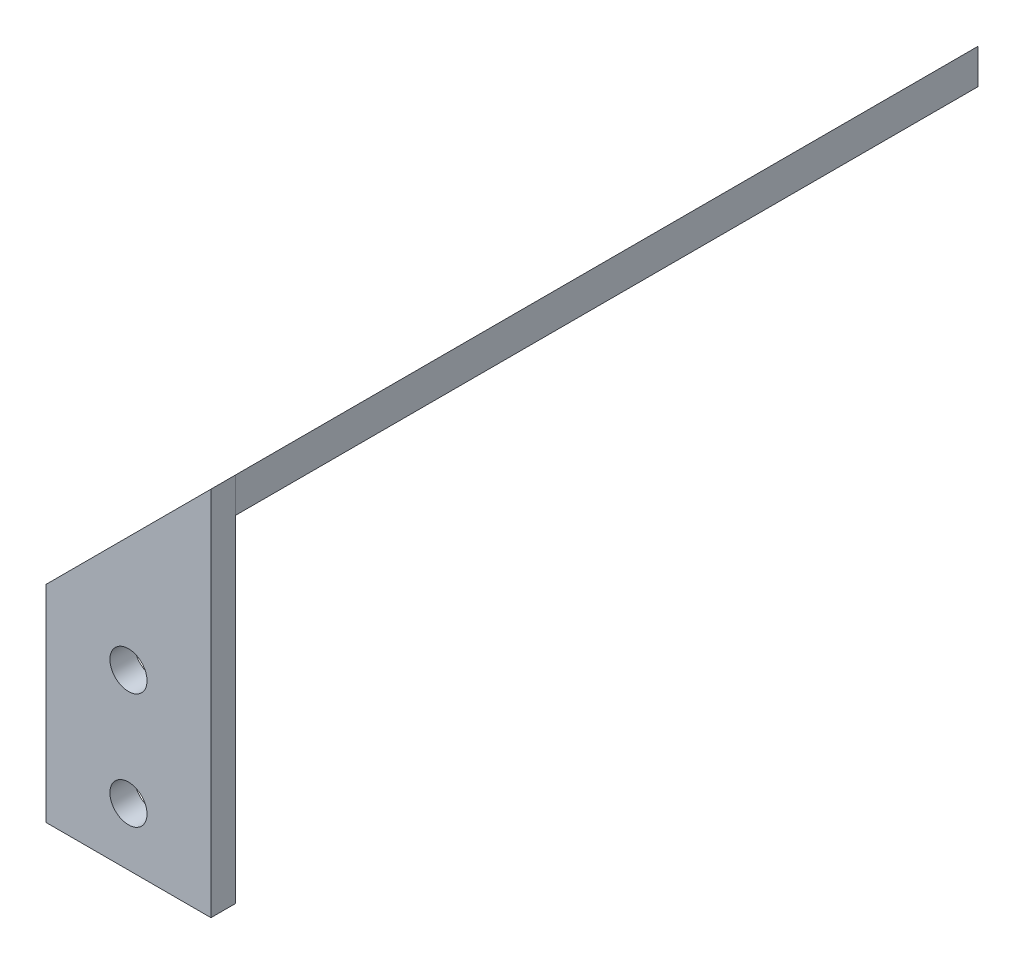
ISO-10303-21;
HEADER;
FILE_DESCRIPTION(('STEP AP214'),'2;1');
FILE_NAME('part.step','',(''),(''),'','','');
FILE_SCHEMA(('AUTOMOTIVE_DESIGN { 1 0 10303 214 1 1 1 1 }'));
ENDSEC;
DATA;
#1=APPLICATION_CONTEXT('core data for automotive mechanical design processes');
#2=APPLICATION_PROTOCOL_DEFINITION('international standard','automotive_design',2000,#1);
#3=PRODUCT_CONTEXT('',#1,'mechanical');
#4=PRODUCT('Part','Part','',(#3));
#5=PRODUCT_RELATED_PRODUCT_CATEGORY('part','',(#4));
#6=PRODUCT_DEFINITION_FORMATION('','',#4);
#7=PRODUCT_DEFINITION_CONTEXT('part definition',#1,'design');
#8=PRODUCT_DEFINITION('design','',#6,#7);
#9=PRODUCT_DEFINITION_SHAPE('','',#8);
#10=(LENGTH_UNIT() NAMED_UNIT(*) SI_UNIT(.MILLI.,.METRE.));
#11=(NAMED_UNIT(*) PLANE_ANGLE_UNIT() SI_UNIT($,.RADIAN.));
#12=(NAMED_UNIT(*) SI_UNIT($,.STERADIAN.) SOLID_ANGLE_UNIT());
#13=UNCERTAINTY_MEASURE_WITH_UNIT(LENGTH_MEASURE(1.E-05),#10,'distance_accuracy_value','');
#14=(GEOMETRIC_REPRESENTATION_CONTEXT(3) GLOBAL_UNCERTAINTY_ASSIGNED_CONTEXT((#13)) GLOBAL_UNIT_ASSIGNED_CONTEXT((#10,
#11,#12)) REPRESENTATION_CONTEXT('',''));
#15=CARTESIAN_POINT('',(0.,0.,0.));
#16=DIRECTION('',(0.,0.,1.));
#17=DIRECTION('',(1.,0.,0.));
#18=AXIS2_PLACEMENT_3D('',#15,#16,#17);
#19=CARTESIAN_POINT('',(22.1213203435596,42.8786796564403,0.));
#20=DIRECTION('',(0.,0.,1.));
#21=DIRECTION('',(1.,0.,0.));
#22=AXIS2_PLACEMENT_3D('',#19,#20,#21);
#23=PLANE('',#22);
#24=DIRECTION('',(0.,-1.,0.));
#25=VECTOR('',#24,1.);
#26=CARTESIAN_POINT('',(20.,44.9999999999999,0.));
#27=LINE('',#26,#25);
#28=CARTESIAN_POINT('',(20.,44.9999999999999,0.));
#29=VERTEX_POINT('',#28);
#30=CARTESIAN_POINT('',(20.,40.7573593128808,0.));
#31=VERTEX_POINT('',#30);
#32=EDGE_CURVE('E85',#29,#31,#27,.T.);
#33=ORIENTED_EDGE('',*,*,#32,.F.);
#34=DIRECTION('',(0.707106781186549,0.707106781186546,0.));
#35=VECTOR('',#34,1.);
#36=CARTESIAN_POINT('',(20.,44.9999999999999,0.));
#37=LINE('',#36,#35);
#38=CARTESIAN_POINT('',(0.,25.,0.));
#39=VERTEX_POINT('',#38);
#40=EDGE_CURVE('E82',#39,#29,#37,.T.);
#41=ORIENTED_EDGE('',*,*,#40,.F.);
#42=DIRECTION('',(-0.707106781186546,0.707106781186549,0.));
#43=VECTOR('',#42,1.);
#44=CARTESIAN_POINT('',(2.12132034355964,22.8786796564404,0.));
#45=LINE('',#44,#43);
#46=CARTESIAN_POINT('',(2.12132034355964,22.8786796564404,0.));
#47=VERTEX_POINT('',#46);
#48=EDGE_CURVE('E12',#47,#39,#45,.T.);
#49=ORIENTED_EDGE('',*,*,#48,.F.);
#50=DIRECTION('',(0.707106781186549,0.707106781186546,0.));
#51=VECTOR('',#50,1.);
#52=CARTESIAN_POINT('',(22.1213203435596,42.8786796564403,0.));
#53=LINE('',#52,#51);
#54=EDGE_CURVE('E93',#47,#31,#53,.T.);
#55=ORIENTED_EDGE('',*,*,#54,.T.);
#56=EDGE_LOOP('',(#33,#41,#49,#55));
#57=FACE_BOUND('',#56,.T.);
#58=ADVANCED_FACE('F43',(#57),#23,.T.);
#59=CARTESIAN_POINT('',(2.12132034355964,22.8786796564404,0.));
#60=DIRECTION('',(-0.707106781186549,-0.707106781186546,0.));
#61=DIRECTION('',(0.707106781186546,-0.707106781186549,0.));
#62=AXIS2_PLACEMENT_3D('',#59,#60,#61);
#63=PLANE('',#62);
#64=DIRECTION('',(0.,0.,1.));
#65=VECTOR('',#64,1.);
#66=CARTESIAN_POINT('',(0.,25.,0.));
#67=LINE('',#66,#65);
#68=CARTESIAN_POINT('',(0.,25.,-90.));
#69=VERTEX_POINT('',#68);
#70=EDGE_CURVE('E77',#69,#39,#67,.T.);
#71=ORIENTED_EDGE('',*,*,#70,.F.);
#72=DIRECTION('',(-0.707106781186546,0.707106781186549,0.));
#73=VECTOR('',#72,1.);
#74=CARTESIAN_POINT('',(2.12132034355963,22.8786796564403,-90.));
#75=LINE('',#74,#73);
#76=CARTESIAN_POINT('',(2.12132034355963,22.8786796564403,-90.));
#77=VERTEX_POINT('',#76);
#78=EDGE_CURVE('E46',#77,#69,#75,.T.);
#79=ORIENTED_EDGE('',*,*,#78,.F.);
#80=DIRECTION('',(0.,0.,1.));
#81=VECTOR('',#80,1.);
#82=CARTESIAN_POINT('',(2.12132034355964,22.8786796564404,0.));
#83=LINE('',#82,#81);
#84=EDGE_CURVE('E79',#77,#47,#83,.T.);
#85=ORIENTED_EDGE('',*,*,#84,.T.);
#86=ORIENTED_EDGE('',*,*,#48,.T.);
#87=EDGE_LOOP('',(#71,#79,#85,#86));
#88=FACE_BOUND('',#87,.T.);
#89=ADVANCED_FACE('F75',(#88),#63,.T.);
#90=CARTESIAN_POINT('',(22.1213203435596,42.8786796564403,-90.));
#91=DIRECTION('',(0.,0.,-1.));
#92=DIRECTION('',(-1.,0.,0.));
#93=AXIS2_PLACEMENT_3D('',#90,#91,#92);
#94=PLANE('',#93);
#95=DIRECTION('',(0.,-1.,0.));
#96=VECTOR('',#95,1.);
#97=CARTESIAN_POINT('',(20.,44.9999999999999,-90.));
#98=LINE('',#97,#96);
#99=CARTESIAN_POINT('',(20.,44.9999999999999,-90.));
#100=VERTEX_POINT('',#99);
#101=CARTESIAN_POINT('',(20.,40.7573593128808,-90.));
#102=VERTEX_POINT('',#101);
#103=EDGE_CURVE('E116',#100,#102,#98,.T.);
#104=ORIENTED_EDGE('',*,*,#103,.T.);
#105=DIRECTION('',(-0.707106781186549,-0.707106781186546,0.));
#106=VECTOR('',#105,1.);
#107=CARTESIAN_POINT('',(22.1213203435596,42.8786796564403,-90.));
#108=LINE('',#107,#106);
#109=EDGE_CURVE('E95',#102,#77,#108,.T.);
#110=ORIENTED_EDGE('',*,*,#109,.T.);
#111=ORIENTED_EDGE('',*,*,#78,.T.);
#112=DIRECTION('',(-0.707106781186549,-0.707106781186546,0.));
#113=VECTOR('',#112,1.);
#114=CARTESIAN_POINT('',(20.,44.9999999999999,-90.));
#115=LINE('',#114,#113);
#116=EDGE_CURVE('E92',#100,#69,#115,.T.);
#117=ORIENTED_EDGE('',*,*,#116,.F.);
#118=EDGE_LOOP('',(#104,#110,#111,#117));
#119=FACE_BOUND('',#118,.T.);
#120=ADVANCED_FACE('F120',(#119),#94,.T.);
#121=CARTESIAN_POINT('',(-10.3786796564404,10.3786796564404,0.));
#122=DIRECTION('',(0.707106781186546,-0.707106781186549,0.));
#123=DIRECTION('',(0.707106781186549,0.707106781186546,0.));
#124=AXIS2_PLACEMENT_3D('',#121,#122,#123);
#125=PLANE('',#124);
#126=DIRECTION('',(0.,0.,1.));
#127=VECTOR('',#126,1.);
#128=CARTESIAN_POINT('',(20.,40.7573593128808,-90.));
#129=LINE('',#128,#127);
#130=EDGE_CURVE('E111',#102,#31,#129,.T.);
#131=ORIENTED_EDGE('',*,*,#130,.T.);
#132=ORIENTED_EDGE('',*,*,#54,.F.);
#133=ORIENTED_EDGE('',*,*,#84,.F.);
#134=ORIENTED_EDGE('',*,*,#109,.F.);
#135=EDGE_LOOP('',(#131,#132,#133,#134));
#136=FACE_BOUND('',#135,.T.);
#137=CARTESIAN_POINT('',(12.1213203435596,32.8786796564403,-30.));
#138=DIRECTION('',(-0.707106781186546,0.707106781186549,0.));
#139=DIRECTION('',(-0.707106781186549,-0.707106781186546,0.));
#140=AXIS2_PLACEMENT_3D('',#137,#138,#139);
#141=CIRCLE('',#140,2.25);
#142=CARTESIAN_POINT('',(10.5303300858899,31.2876893987706,-30.));
#143=VERTEX_POINT('',#142);
#144=EDGE_CURVE('E105',#143,#143,#141,.T.);
#145=ORIENTED_EDGE('',*,*,#144,.T.);
#146=EDGE_LOOP('',(#145));
#147=FACE_BOUND('',#146,.T.);
#148=CARTESIAN_POINT('',(12.1213203435596,32.8786796564403,-80.));
#149=DIRECTION('',(-0.707106781186546,0.707106781186549,0.));
#150=DIRECTION('',(-0.707106781186549,-0.707106781186546,0.));
#151=AXIS2_PLACEMENT_3D('',#148,#149,#150);
#152=CIRCLE('',#151,2.25);
#153=CARTESIAN_POINT('',(10.5303300858899,31.2876893987706,-80.));
#154=VERTEX_POINT('',#153);
#155=EDGE_CURVE('E89',#154,#154,#152,.T.);
#156=ORIENTED_EDGE('',*,*,#155,.T.);
#157=EDGE_LOOP('',(#156));
#158=FACE_BOUND('',#157,.T.);
#159=ADVANCED_FACE('F127',(#136,#147,#158),#125,.T.);
#160=CARTESIAN_POINT('',(-12.5,12.5,0.));
#161=DIRECTION('',(0.707106781186546,-0.707106781186549,0.));
#162=DIRECTION('',(0.707106781186549,0.707106781186546,0.));
#163=AXIS2_PLACEMENT_3D('',#160,#161,#162);
#164=PLANE('',#163);
#165=CARTESIAN_POINT('',(10.,35.,-30.));
#166=DIRECTION('',(-0.707106781186546,0.707106781186549,0.));
#167=DIRECTION('',(-0.707106781186549,-0.707106781186546,0.));
#168=AXIS2_PLACEMENT_3D('',#165,#166,#167);
#169=CIRCLE('',#168,2.25);
#170=CARTESIAN_POINT('',(8.40900974233027,33.4090097423302,-30.));
#171=VERTEX_POINT('',#170);
#172=EDGE_CURVE('E108',#171,#171,#169,.T.);
#173=ORIENTED_EDGE('',*,*,#172,.F.);
#174=EDGE_LOOP('',(#173));
#175=FACE_BOUND('',#174,.T.);
#176=CARTESIAN_POINT('',(9.99999999999999,35.,-80.));
#177=DIRECTION('',(-0.707106781186546,0.707106781186549,0.));
#178=DIRECTION('',(-0.707106781186549,-0.707106781186546,0.));
#179=AXIS2_PLACEMENT_3D('',#176,#177,#178);
#180=CIRCLE('',#179,2.25);
#181=CARTESIAN_POINT('',(8.40900974233026,33.4090097423302,-80.));
#182=VERTEX_POINT('',#181);
#183=EDGE_CURVE('E102',#182,#182,#180,.T.);
#184=ORIENTED_EDGE('',*,*,#183,.F.);
#185=EDGE_LOOP('',(#184));
#186=FACE_BOUND('',#185,.T.);
#187=ORIENTED_EDGE('',*,*,#40,.T.);
#188=DIRECTION('',(0.,0.,-1.));
#189=VECTOR('',#188,1.);
#190=CARTESIAN_POINT('',(20.,44.9999999999999,0.));
#191=LINE('',#190,#189);
#192=EDGE_CURVE('E88',#29,#100,#191,.T.);
#193=ORIENTED_EDGE('',*,*,#192,.T.);
#194=ORIENTED_EDGE('',*,*,#116,.T.);
#195=ORIENTED_EDGE('',*,*,#70,.T.);
#196=EDGE_LOOP('',(#187,#193,#194,#195));
#197=FACE_BOUND('',#196,.T.);
#198=ADVANCED_FACE('F91',(#175,#186,#197),#164,.F.);
#199=CARTESIAN_POINT('',(12.1213203435596,32.8786796564403,-80.));
#200=DIRECTION('',(-0.707106781186546,0.707106781186549,0.));
#201=DIRECTION('',(-0.707106781186549,-0.707106781186546,0.));
#202=AXIS2_PLACEMENT_3D('',#199,#200,#201);
#203=CYLINDRICAL_SURFACE('',#202,2.25);
#204=ORIENTED_EDGE('',*,*,#155,.F.);
#205=EDGE_LOOP('',(#204));
#206=FACE_BOUND('',#205,.T.);
#207=ORIENTED_EDGE('',*,*,#183,.T.);
#208=EDGE_LOOP('',(#207));
#209=FACE_BOUND('',#208,.T.);
#210=ADVANCED_FACE('F137',(#206,#209),#203,.F.);
#211=CARTESIAN_POINT('',(12.1213203435596,32.8786796564403,-30.));
#212=DIRECTION('',(-0.707106781186546,0.707106781186549,0.));
#213=DIRECTION('',(-0.707106781186549,-0.707106781186546,0.));
#214=AXIS2_PLACEMENT_3D('',#211,#212,#213);
#215=CYLINDRICAL_SURFACE('',#214,2.25);
#216=ORIENTED_EDGE('',*,*,#144,.F.);
#217=EDGE_LOOP('',(#216));
#218=FACE_BOUND('',#217,.T.);
#219=ORIENTED_EDGE('',*,*,#172,.T.);
#220=EDGE_LOOP('',(#219));
#221=FACE_BOUND('',#220,.T.);
#222=ADVANCED_FACE('F132',(#218,#221),#215,.F.);
#223=CARTESIAN_POINT('',(20.,44.9999999999999,-90.));
#224=DIRECTION('',(-1.,0.,0.));
#225=DIRECTION('',(0.,-1.,0.));
#226=AXIS2_PLACEMENT_3D('',#223,#224,#225);
#227=PLANE('',#226);
#228=ORIENTED_EDGE('',*,*,#32,.T.);
#229=ORIENTED_EDGE('',*,*,#130,.F.);
#230=ORIENTED_EDGE('',*,*,#103,.F.);
#231=ORIENTED_EDGE('',*,*,#192,.F.);
#232=EDGE_LOOP('',(#228,#229,#230,#231));
#233=FACE_BOUND('',#232,.T.);
#234=ADVANCED_FACE('F130',(#233),#227,.F.);
#235=CLOSED_SHELL('',(#58,#89,#120,#159,#198,#210,#222,#234));
#236=MANIFOLD_SOLID_BREP('B2',#235);
#237=CARTESIAN_POINT('',(0.,0.,3.));
#238=DIRECTION('',(0.,0.,-1.));
#239=DIRECTION('',(-1.,0.,0.));
#240=AXIS2_PLACEMENT_3D('',#237,#238,#239);
#241=PLANE('',#240);
#242=DIRECTION('',(0.,-1.,0.));
#243=VECTOR('',#242,1.);
#244=CARTESIAN_POINT('',(0.,0.,3.));
#245=LINE('',#244,#243);
#246=CARTESIAN_POINT('',(0.,25.,3.));
#247=VERTEX_POINT('',#246);
#248=CARTESIAN_POINT('',(0.,0.,3.));
#249=VERTEX_POINT('',#248);
#250=EDGE_CURVE('E260',#247,#249,#245,.T.);
#251=ORIENTED_EDGE('',*,*,#250,.T.);
#252=DIRECTION('',(1.,0.,0.));
#253=VECTOR('',#252,1.);
#254=CARTESIAN_POINT('',(0.,0.,3.));
#255=LINE('',#254,#253);
#256=CARTESIAN_POINT('',(20.,0.,3.));
#257=VERTEX_POINT('',#256);
#258=EDGE_CURVE('E255',#249,#257,#255,.T.);
#259=ORIENTED_EDGE('',*,*,#258,.T.);
#260=DIRECTION('',(0.,1.,0.));
#261=VECTOR('',#260,1.);
#262=CARTESIAN_POINT('',(20.,0.,3.));
#263=LINE('',#262,#261);
#264=CARTESIAN_POINT('',(20.,44.9999999999999,3.));
#265=VERTEX_POINT('',#264);
#266=EDGE_CURVE('E258',#257,#265,#263,.T.);
#267=ORIENTED_EDGE('',*,*,#266,.T.);
#268=DIRECTION('',(-0.707106781186549,-0.707106781186546,0.));
#269=VECTOR('',#268,1.);
#270=CARTESIAN_POINT('',(0.,25.,3.));
#271=LINE('',#270,#269);
#272=EDGE_CURVE('E226',#265,#247,#271,.T.);
#273=ORIENTED_EDGE('',*,*,#272,.T.);
#274=EDGE_LOOP('',(#251,#259,#267,#273));
#275=FACE_BOUND('',#274,.T.);
#276=CARTESIAN_POINT('',(10.,7.,3.));
#277=DIRECTION('',(0.,0.,1.));
#278=DIRECTION('',(1.,0.,0.));
#279=AXIS2_PLACEMENT_3D('',#276,#277,#278);
#280=CIRCLE('',#279,2.25);
#281=CARTESIAN_POINT('',(12.25,7.,3.));
#282=VERTEX_POINT('',#281);
#283=EDGE_CURVE('E276',#282,#282,#280,.T.);
#284=ORIENTED_EDGE('',*,*,#283,.F.);
#285=EDGE_LOOP('',(#284));
#286=FACE_BOUND('',#285,.T.);
#287=CARTESIAN_POINT('',(10.,21.,3.));
#288=DIRECTION('',(0.,0.,1.));
#289=DIRECTION('',(1.,0.,0.));
#290=AXIS2_PLACEMENT_3D('',#287,#288,#289);
#291=CIRCLE('',#290,2.25);
#292=CARTESIAN_POINT('',(12.25,21.,3.));
#293=VERTEX_POINT('',#292);
#294=EDGE_CURVE('E291',#293,#293,#291,.T.);
#295=ORIENTED_EDGE('',*,*,#294,.F.);
#296=EDGE_LOOP('',(#295));
#297=FACE_BOUND('',#296,.T.);
#298=ADVANCED_FACE('F209',(#275,#286,#297),#241,.F.);
#299=CARTESIAN_POINT('',(0.,0.,0.));
#300=DIRECTION('',(0.,0.,-1.));
#301=DIRECTION('',(-1.,0.,0.));
#302=AXIS2_PLACEMENT_3D('',#299,#300,#301);
#303=PLANE('',#302);
#304=CARTESIAN_POINT('',(10.,7.,0.));
#305=DIRECTION('',(0.,0.,1.));
#306=DIRECTION('',(1.,0.,0.));
#307=AXIS2_PLACEMENT_3D('',#304,#305,#306);
#308=CIRCLE('',#307,2.25);
#309=CARTESIAN_POINT('',(12.25,7.,0.));
#310=VERTEX_POINT('',#309);
#311=EDGE_CURVE('E288',#310,#310,#308,.T.);
#312=ORIENTED_EDGE('',*,*,#311,.T.);
#313=EDGE_LOOP('',(#312));
#314=FACE_BOUND('',#313,.T.);
#315=DIRECTION('',(0.,-1.,0.));
#316=VECTOR('',#315,1.);
#317=CARTESIAN_POINT('',(0.,0.,0.));
#318=LINE('',#317,#316);
#319=CARTESIAN_POINT('',(0.,25.,0.));
#320=VERTEX_POINT('',#319);
#321=CARTESIAN_POINT('',(0.,0.,0.));
#322=VERTEX_POINT('',#321);
#323=EDGE_CURVE('E273',#320,#322,#318,.T.);
#324=ORIENTED_EDGE('',*,*,#323,.F.);
#325=DIRECTION('',(-0.707106781186549,-0.707106781186546,0.));
#326=VECTOR('',#325,1.);
#327=CARTESIAN_POINT('',(0.,25.,0.));
#328=LINE('',#327,#326);
#329=CARTESIAN_POINT('',(20.,44.9999999999999,0.));
#330=VERTEX_POINT('',#329);
#331=EDGE_CURVE('E248',#330,#320,#328,.T.);
#332=ORIENTED_EDGE('',*,*,#331,.F.);
#333=DIRECTION('',(0.,1.,0.));
#334=VECTOR('',#333,1.);
#335=CARTESIAN_POINT('',(20.,44.9999999999999,0.));
#336=LINE('',#335,#334);
#337=CARTESIAN_POINT('',(20.,0.,0.));
#338=VERTEX_POINT('',#337);
#339=EDGE_CURVE('E242',#338,#330,#336,.T.);
#340=ORIENTED_EDGE('',*,*,#339,.F.);
#341=DIRECTION('',(1.,0.,0.));
#342=VECTOR('',#341,1.);
#343=CARTESIAN_POINT('',(0.,0.,0.));
#344=LINE('',#343,#342);
#345=EDGE_CURVE('E265',#322,#338,#344,.T.);
#346=ORIENTED_EDGE('',*,*,#345,.F.);
#347=EDGE_LOOP('',(#324,#332,#340,#346));
#348=FACE_BOUND('',#347,.T.);
#349=CARTESIAN_POINT('',(10.,21.,0.));
#350=DIRECTION('',(0.,0.,1.));
#351=DIRECTION('',(1.,0.,0.));
#352=AXIS2_PLACEMENT_3D('',#349,#350,#351);
#353=CIRCLE('',#352,2.25);
#354=CARTESIAN_POINT('',(12.25,21.,0.));
#355=VERTEX_POINT('',#354);
#356=EDGE_CURVE('E294',#355,#355,#353,.T.);
#357=ORIENTED_EDGE('',*,*,#356,.T.);
#358=EDGE_LOOP('',(#357));
#359=FACE_BOUND('',#358,.T.);
#360=ADVANCED_FACE('F284',(#314,#348,#359),#303,.T.);
#361=CARTESIAN_POINT('',(0.,0.,3.));
#362=DIRECTION('',(1.,0.,0.));
#363=DIRECTION('',(0.,0.,-1.));
#364=AXIS2_PLACEMENT_3D('',#361,#362,#363);
#365=PLANE('',#364);
#366=ORIENTED_EDGE('',*,*,#323,.T.);
#367=DIRECTION('',(0.,0.,-1.));
#368=VECTOR('',#367,1.);
#369=CARTESIAN_POINT('',(0.,0.,3.));
#370=LINE('',#369,#368);
#371=EDGE_CURVE('E41',#249,#322,#370,.T.);
#372=ORIENTED_EDGE('',*,*,#371,.F.);
#373=ORIENTED_EDGE('',*,*,#250,.F.);
#374=DIRECTION('',(0.,0.,-1.));
#375=VECTOR('',#374,1.);
#376=CARTESIAN_POINT('',(0.,25.,3.));
#377=LINE('',#376,#375);
#378=EDGE_CURVE('E269',#247,#320,#377,.T.);
#379=ORIENTED_EDGE('',*,*,#378,.T.);
#380=EDGE_LOOP('',(#366,#372,#373,#379));
#381=FACE_BOUND('',#380,.T.);
#382=ADVANCED_FACE('F211',(#381),#365,.F.);
#383=CARTESIAN_POINT('',(0.,0.,3.));
#384=DIRECTION('',(0.,1.,0.));
#385=DIRECTION('',(0.,0.,1.));
#386=AXIS2_PLACEMENT_3D('',#383,#384,#385);
#387=PLANE('',#386);
#388=ORIENTED_EDGE('',*,*,#345,.T.);
#389=DIRECTION('',(0.,0.,-1.));
#390=VECTOR('',#389,1.);
#391=CARTESIAN_POINT('',(20.,0.,3.));
#392=LINE('',#391,#390);
#393=EDGE_CURVE('E218',#257,#338,#392,.T.);
#394=ORIENTED_EDGE('',*,*,#393,.F.);
#395=ORIENTED_EDGE('',*,*,#258,.F.);
#396=ORIENTED_EDGE('',*,*,#371,.T.);
#397=EDGE_LOOP('',(#388,#394,#395,#396));
#398=FACE_BOUND('',#397,.T.);
#399=ADVANCED_FACE('F264',(#398),#387,.F.);
#400=CARTESIAN_POINT('',(20.,44.9999999999999,3.));
#401=DIRECTION('',(-1.,0.,0.));
#402=DIRECTION('',(0.,-1.,0.));
#403=AXIS2_PLACEMENT_3D('',#400,#401,#402);
#404=PLANE('',#403);
#405=ORIENTED_EDGE('',*,*,#339,.T.);
#406=DIRECTION('',(0.,0.,-1.));
#407=VECTOR('',#406,1.);
#408=CARTESIAN_POINT('',(20.,44.9999999999999,3.));
#409=LINE('',#408,#407);
#410=EDGE_CURVE('E266',#265,#330,#409,.T.);
#411=ORIENTED_EDGE('',*,*,#410,.F.);
#412=ORIENTED_EDGE('',*,*,#266,.F.);
#413=ORIENTED_EDGE('',*,*,#393,.T.);
#414=EDGE_LOOP('',(#405,#411,#412,#413));
#415=FACE_BOUND('',#414,.T.);
#416=ADVANCED_FACE('F267',(#415),#404,.F.);
#417=CARTESIAN_POINT('',(0.,25.,3.));
#418=DIRECTION('',(0.707106781186546,-0.707106781186549,0.));
#419=DIRECTION('',(0.707106781186549,0.707106781186546,0.));
#420=AXIS2_PLACEMENT_3D('',#417,#418,#419);
#421=PLANE('',#420);
#422=ORIENTED_EDGE('',*,*,#331,.T.);
#423=ORIENTED_EDGE('',*,*,#378,.F.);
#424=ORIENTED_EDGE('',*,*,#272,.F.);
#425=ORIENTED_EDGE('',*,*,#410,.T.);
#426=EDGE_LOOP('',(#422,#423,#424,#425));
#427=FACE_BOUND('',#426,.T.);
#428=ADVANCED_FACE('F281',(#427),#421,.F.);
#429=CARTESIAN_POINT('',(10.,7.,3.));
#430=DIRECTION('',(0.,0.,-1.));
#431=DIRECTION('',(-1.,0.,0.));
#432=AXIS2_PLACEMENT_3D('',#429,#430,#431);
#433=CYLINDRICAL_SURFACE('',#432,2.25);
#434=ORIENTED_EDGE('',*,*,#283,.T.);
#435=EDGE_LOOP('',(#434));
#436=FACE_BOUND('',#435,.T.);
#437=ORIENTED_EDGE('',*,*,#311,.F.);
#438=EDGE_LOOP('',(#437));
#439=FACE_BOUND('',#438,.T.);
#440=ADVANCED_FACE('F311',(#436,#439),#433,.F.);
#441=CARTESIAN_POINT('',(10.,21.,3.));
#442=DIRECTION('',(0.,0.,-1.));
#443=DIRECTION('',(-1.,0.,0.));
#444=AXIS2_PLACEMENT_3D('',#441,#442,#443);
#445=CYLINDRICAL_SURFACE('',#444,2.25);
#446=ORIENTED_EDGE('',*,*,#294,.T.);
#447=EDGE_LOOP('',(#446));
#448=FACE_BOUND('',#447,.T.);
#449=ORIENTED_EDGE('',*,*,#356,.F.);
#450=EDGE_LOOP('',(#449));
#451=FACE_BOUND('',#450,.T.);
#452=ADVANCED_FACE('F300',(#448,#451),#445,.F.);
#453=CLOSED_SHELL('',(#298,#360,#382,#399,#416,#428,#440,#452));
#454=MANIFOLD_SOLID_BREP('B6',#453);
#455=ADVANCED_BREP_SHAPE_REPRESENTATION('',(#18,#236,#454),#14);
#456=SHAPE_DEFINITION_REPRESENTATION(#9,#455);
ENDSEC;
END-ISO-10303-21;
